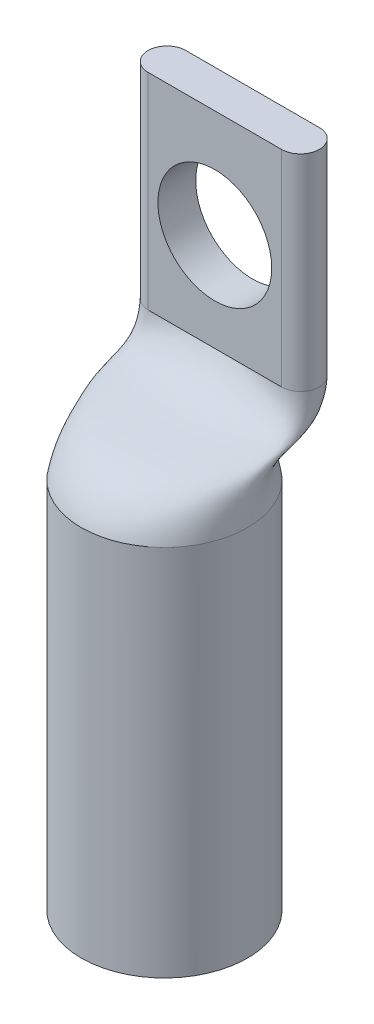
ISO-10303-21;
HEADER;
FILE_DESCRIPTION(('STEP AP214'),'2;1');
FILE_NAME('part.step','',(''),(''),'','','');
FILE_SCHEMA(('AUTOMOTIVE_DESIGN { 1 0 10303 214 1 1 1 1 }'));
ENDSEC;
DATA;
#1=APPLICATION_CONTEXT('core data for automotive mechanical design processes');
#2=APPLICATION_PROTOCOL_DEFINITION('international standard','automotive_design',2000,#1);
#3=PRODUCT_CONTEXT('',#1,'mechanical');
#4=PRODUCT('Part','Part','',(#3));
#5=PRODUCT_RELATED_PRODUCT_CATEGORY('part','',(#4));
#6=PRODUCT_DEFINITION_FORMATION('','',#4);
#7=PRODUCT_DEFINITION_CONTEXT('part definition',#1,'design');
#8=PRODUCT_DEFINITION('design','',#6,#7);
#9=PRODUCT_DEFINITION_SHAPE('','',#8);
#10=(LENGTH_UNIT() NAMED_UNIT(*) SI_UNIT(.MILLI.,.METRE.));
#11=(NAMED_UNIT(*) PLANE_ANGLE_UNIT() SI_UNIT($,.RADIAN.));
#12=(NAMED_UNIT(*) SI_UNIT($,.STERADIAN.) SOLID_ANGLE_UNIT());
#13=UNCERTAINTY_MEASURE_WITH_UNIT(LENGTH_MEASURE(1.E-05),#10,'distance_accuracy_value','');
#14=(GEOMETRIC_REPRESENTATION_CONTEXT(3) GLOBAL_UNCERTAINTY_ASSIGNED_CONTEXT((#13)) GLOBAL_UNIT_ASSIGNED_CONTEXT((#10,
#11,#12)) REPRESENTATION_CONTEXT('',''));
#15=CARTESIAN_POINT('',(0.,0.,0.));
#16=DIRECTION('',(0.,0.,1.));
#17=DIRECTION('',(1.,0.,0.));
#18=AXIS2_PLACEMENT_3D('',#15,#16,#17);
#19=CARTESIAN_POINT('',(0.,22.5552,0.));
#20=DIRECTION('',(0.,-1.,0.));
#21=DIRECTION('',(0.,0.,-1.));
#22=AXIS2_PLACEMENT_3D('',#19,#20,#21);
#23=CYLINDRICAL_SURFACE('',#22,5.0292);
#24=CARTESIAN_POINT('',(0.,22.5552,5.0292));
#25=CARTESIAN_POINT('',(0.565003535712212,22.5552,5.0292));
#26=CARTESIAN_POINT('',(1.74173787147774,22.5552,4.83391292208376));
#27=CARTESIAN_POINT('',(3.32282143010614,22.5552,3.91513447500991));
#28=CARTESIAN_POINT('',(4.42651562695378,22.5552,2.57113400399745));
#29=CARTESIAN_POINT('',(4.79679303246483,22.5552,1.5886920694497));
#30=CARTESIAN_POINT('',(4.93875651309624,22.5552,0.961686696660969));
#31=CARTESIAN_POINT('',(4.98610028735867,22.5552,0.69925596259311));
#32=CARTESIAN_POINT('',(5.01801373395576,22.5552,0.366689213128491));
#33=CARTESIAN_POINT('',(5.03195664756186,22.5552,0.0502353168386094));
#34=CARTESIAN_POINT('',(5.02649935860845,22.5552,-0.257972690983758));
#35=CARTESIAN_POINT('',(5.00021219752697,22.5552,-0.565801775045835));
#36=CARTESIAN_POINT('',(4.9537543619307,22.5552,-0.880528507479231));
#37=CARTESIAN_POINT('',(4.88778504943293,22.5552,-1.20942946041556));
#38=CARTESIAN_POINT('',(4.81230012588817,22.5552,-1.46936391005863));
#39=CARTESIAN_POINT('',(4.60765387433841,22.5552,-2.07193342851068));
#40=CARTESIAN_POINT('',(4.15884205058131,22.5552,-2.96244378646528));
#41=CARTESIAN_POINT('',(3.0681828198682,22.5552,-4.0897903902112));
#42=CARTESIAN_POINT('',(1.63275308276854,22.5552,-4.8499106931142));
#43=CARTESIAN_POINT('',(0.,22.5552,-5.11906417666359));
#44=CARTESIAN_POINT('',(-1.63275308276853,22.5552,-4.8499106931142));
#45=CARTESIAN_POINT('',(-3.06818281986821,22.5552,-4.0897903902112));
#46=CARTESIAN_POINT('',(-4.1588420505813,22.5552,-2.96244378646527));
#47=CARTESIAN_POINT('',(-4.60765387433841,22.5552,-2.07193342851068));
#48=CARTESIAN_POINT('',(-4.81230012588817,22.5552,-1.46936391005863));
#49=CARTESIAN_POINT('',(-4.88778504943293,22.5552,-1.20942946041555));
#50=CARTESIAN_POINT('',(-4.9537543619307,22.5552,-0.880528507479231));
#51=CARTESIAN_POINT('',(-5.00021219752697,22.5552,-0.565801775045837));
#52=CARTESIAN_POINT('',(-5.02649935860845,22.5552,-0.25797269098376));
#53=CARTESIAN_POINT('',(-5.03195664756186,22.5552,0.0502353168386068));
#54=CARTESIAN_POINT('',(-5.01801373395575,22.5552,0.366689213128489));
#55=CARTESIAN_POINT('',(-4.98610028735867,22.5552,0.699255962593107));
#56=CARTESIAN_POINT('',(-4.93875651309624,22.5552,0.961686696660966));
#57=CARTESIAN_POINT('',(-4.79679303246483,22.5552,1.5886920694497));
#58=CARTESIAN_POINT('',(-4.4265156269538,22.5552,2.57113400399745));
#59=CARTESIAN_POINT('',(-3.32282143010613,22.5552,3.9151344750099));
#60=CARTESIAN_POINT('',(-1.74173787147775,22.5552,4.83391292208376));
#61=CARTESIAN_POINT('',(-0.565003535712213,22.5552,5.0292));
#62=CARTESIAN_POINT('',(0.,22.5552,5.0292));
#63=B_SPLINE_CURVE_WITH_KNOTS('',3,(#24,#25,#26,#27,#28,#29,#30,#31,#32,#33,#34,#35,#36,#37,#38,
#39,#40,#41,#42,#43,#44,#45,#46,#47,#48,#49,#50,#51,#52,#53,#54,#55,#56,#57,#58,#59,#60,#61,
#62),.UNSPECIFIED.,.T.,.F.,(4,1,1,1,2,1,1,1,1,1,1,1,2,1,1,1,1,1,1,1,2,1,1,1,1,1,1,1,2,1,1,1,4),
(0.,0.0484531112377626,0.0969062224755251,0.145359333713288,0.19381244495105,0.208901194509636,
0.223989944068222,0.239078693626807,0.254167443185393,0.269256192743978,0.284344942302564,
0.29943369186115,0.314522441419735,0.360891831064801,0.407261220709868,0.453630610354934,0.5,
0.546369389645066,0.592738779290132,0.639108168935199,0.685477558580265,0.70056630813885,
0.715655057697436,0.730743807256022,0.745832556814607,0.760921306373193,0.776010055931778,
0.791098805490364,0.80618755504895,0.854640666286712,0.903093777524475,0.951546888762237,1.),.UNSPECIFIED.);
#64=CARTESIAN_POINT('',(0.,22.5552,5.0292));
#65=VERTEX_POINT('',#64);
#66=EDGE_CURVE('E13',#65,#65,#63,.T.);
#67=ORIENTED_EDGE('',*,*,#66,.F.);
#68=EDGE_LOOP('',(#67));
#69=FACE_BOUND('',#68,.T.);
#70=CARTESIAN_POINT('',(0.,0.,0.));
#71=DIRECTION('',(0.,1.,0.));
#72=DIRECTION('',(0.,0.,1.));
#73=AXIS2_PLACEMENT_3D('',#70,#71,#72);
#74=CIRCLE('',#73,5.0292);
#75=CARTESIAN_POINT('',(0.,0.,5.0292));
#76=VERTEX_POINT('',#75);
#77=EDGE_CURVE('E155',#76,#76,#74,.T.);
#78=ORIENTED_EDGE('',*,*,#77,.T.);
#79=EDGE_LOOP('',(#78));
#80=FACE_BOUND('',#79,.T.);
#81=ADVANCED_FACE('F145',(#69,#80),#23,.T.);
#82=CARTESIAN_POINT('',(0.,0.,0.));
#83=DIRECTION('',(0.,1.,0.));
#84=DIRECTION('',(0.,0.,1.));
#85=AXIS2_PLACEMENT_3D('',#82,#83,#84);
#86=PLANE('',#85);
#87=CARTESIAN_POINT('',(0.,0.,0.));
#88=DIRECTION('',(0.,-1.,0.));
#89=DIRECTION('',(0.,0.,-1.));
#90=AXIS2_PLACEMENT_3D('',#87,#88,#89);
#91=CIRCLE('',#90,3.683);
#92=CARTESIAN_POINT('',(0.,0.,-3.683));
#93=VERTEX_POINT('',#92);
#94=EDGE_CURVE('E298',#93,#93,#91,.T.);
#95=ORIENTED_EDGE('',*,*,#94,.F.);
#96=EDGE_LOOP('',(#95));
#97=FACE_BOUND('',#96,.T.);
#98=ORIENTED_EDGE('',*,*,#77,.F.);
#99=EDGE_LOOP('',(#98));
#100=FACE_BOUND('',#99,.T.);
#101=ADVANCED_FACE('F308',(#97,#100),#86,.F.);
#102=CARTESIAN_POINT('',(0.,27.8892,0.));
#103=DIRECTION('',(0.,-1.,0.));
#104=DIRECTION('',(0.,0.,-1.));
#105=AXIS2_PLACEMENT_3D('',#102,#103,#104);
#106=CYLINDRICAL_SURFACE('',#105,3.683);
#107=CARTESIAN_POINT('',(0.,22.5552,0.));
#108=DIRECTION('',(0.,1.,0.));
#109=DIRECTION('',(0.,0.,1.));
#110=AXIS2_PLACEMENT_3D('',#107,#108,#109);
#111=CIRCLE('',#110,3.683);
#112=CARTESIAN_POINT('',(0.,22.5552,3.683));
#113=VERTEX_POINT('',#112);
#114=EDGE_CURVE('E259',#113,#113,#111,.F.);
#115=ORIENTED_EDGE('',*,*,#114,.F.);
#116=EDGE_LOOP('',(#115));
#117=FACE_BOUND('',#116,.T.);
#118=ORIENTED_EDGE('',*,*,#94,.T.);
#119=EDGE_LOOP('',(#118));
#120=FACE_BOUND('',#119,.T.);
#121=ADVANCED_FACE('F305',(#117,#120),#106,.F.);
#122=CARTESIAN_POINT('',(0.,22.5552,0.));
#123=DIRECTION('',(0.,1.,0.));
#124=DIRECTION('',(0.,0.,1.));
#125=AXIS2_PLACEMENT_3D('',#122,#123,#124);
#126=PLANE('',#125);
#127=ORIENTED_EDGE('',*,*,#114,.T.);
#128=EDGE_LOOP('',(#127));
#129=FACE_BOUND('',#128,.T.);
#130=ADVANCED_FACE('F303',(#129),#126,.F.);
#131=CARTESIAN_POINT('',(0.,22.5552,5.0292));
#132=CARTESIAN_POINT('',(0.,26.7626227358973,3.6868671975364));
#133=CARTESIAN_POINT('',(0.,24.2731069858936,-1.39073043871304));
#134=CARTESIAN_POINT('',(0.,27.9,-3.048));
#135=CARTESIAN_POINT('',(0.565003535712212,22.5552,5.0292));
#136=CARTESIAN_POINT('',(0.488852357141475,26.7626227358973,3.6868671975364));
#137=CARTESIAN_POINT('',(0.412701178570737,24.2731069858936,-1.39073043871304));
#138=CARTESIAN_POINT('',(0.33655,27.9,-3.048));
#139=CARTESIAN_POINT('',(1.74173787147774,22.5552,4.83391292208376));
#140=CARTESIAN_POINT('',(1.49010698302913,26.7626227358973,3.5566758122589));
#141=CARTESIAN_POINT('',(1.23847609458051,24.2731069858936,-1.45582613135179));
#142=CARTESIAN_POINT('',(0.986845206131904,27.9,-3.048));
#143=CARTESIAN_POINT('',(3.32282143010614,22.5552,3.91513447500991));
#144=CARTESIAN_POINT('',(2.86382426973833,26.7626227358973,2.944156847543));
#145=CARTESIAN_POINT('',(2.40482710937052,24.2731069858936,-1.76208561370975));
#146=CARTESIAN_POINT('',(1.94582994900271,27.9,-3.04800000000001));
#147=CARTESIAN_POINT('',(4.42651562695378,22.5552,2.57113400399745));
#148=CARTESIAN_POINT('',(3.92880476757705,26.7626227358973,2.0481565335347));
#149=CARTESIAN_POINT('',(3.43109390820032,24.2731069858936,-2.21008577071389));
#150=CARTESIAN_POINT('',(2.93338304882358,27.9,-3.048));
#151=CARTESIAN_POINT('',(4.79679303246483,22.5552,1.5886920694497));
#152=CARTESIAN_POINT('',(4.4134689291573,26.7626227358973,1.3931952438362));
#153=CARTESIAN_POINT('',(4.03014482584978,24.2731069858936,-2.53756641556314));
#154=CARTESIAN_POINT('',(3.64682072254225,27.9,-3.048));
#155=CARTESIAN_POINT('',(4.93875651309624,22.5552,0.961686696660969));
#156=CARTESIAN_POINT('',(4.67937224553908,26.7626227358973,0.975191661977044));
#157=CARTESIAN_POINT('',(4.41998797798192,24.2731069858936,-2.74656820649272));
#158=CARTESIAN_POINT('',(4.16060371042476,27.9,-3.048));
#159=CARTESIAN_POINT('',(4.98610028735867,22.5552,0.69925596259311));
#160=CARTESIAN_POINT('',(4.79730958023918,26.7626227358973,0.78720146032038));
#161=CARTESIAN_POINT('',(4.60851887311969,24.2731069858936,-2.86011787573819));
#162=CARTESIAN_POINT('',(4.41972816600021,27.9,-3.08710913683427));
#163=CARTESIAN_POINT('',(5.01801373395576,22.5552,0.366689213128491));
#164=CARTESIAN_POINT('',(4.94775101330283,26.7626227358973,0.493461396000666));
#165=CARTESIAN_POINT('',(4.8774882926499,24.2731069858935,-3.115031254913));
#166=CARTESIAN_POINT('',(4.80722557199697,27.8999999999999,-3.30319583086418));
#167=CARTESIAN_POINT('',(5.03195664756186,22.5552,0.0502353168386094));
#168=CARTESIAN_POINT('',(5.05760478104157,26.7626227358974,0.152462977992854));
#169=CARTESIAN_POINT('',(5.08325291452127,24.2731069858936,-3.48057419463874));
#170=CARTESIAN_POINT('',(5.10890104800097,27.9,-3.69328329230785));
#171=CARTESIAN_POINT('',(5.02649935860845,22.5552,-0.257972690983758));
#172=CARTESIAN_POINT('',(5.09139410080074,26.7626227358974,-0.22390065394068));
#173=CARTESIAN_POINT('',(5.15628884299302,24.2731069858936,-3.92509345068344));
#174=CARTESIAN_POINT('',(5.22118358518531,27.9,-4.20595817246372));
#175=CARTESIAN_POINT('',(5.00021219752697,22.5552,-0.565801775045835));
#176=CARTESIAN_POINT('',(5.03235786746374,26.7626227358973,-0.597827558654946));
#177=CARTESIAN_POINT('',(5.0645035374005,24.2731069858936,-4.3651181760499));
#178=CARTESIAN_POINT('',(5.09664920733727,27.9,-4.71208071848236));
#179=CARTESIAN_POINT('',(4.9537543619307,22.5552,-0.880528507479231));
#180=CARTESIAN_POINT('',(4.90007616320691,26.7626227358973,-0.933459115513332));
#181=CARTESIAN_POINT('',(4.84639796448311,24.2731069858935,-4.72165455733327));
#182=CARTESIAN_POINT('',(4.79271976575932,27.9,-5.08952192419073));
#183=CARTESIAN_POINT('',(4.88778504943293,22.5552,-1.20942946041556));
#184=CARTESIAN_POINT('',(4.72896887715214,26.7626227358973,-1.22175270617314));
#185=CARTESIAN_POINT('',(4.57015270487134,24.2731069858935,-4.96934078571655));
#186=CARTESIAN_POINT('',(4.41133653259055,27.9,-5.29660079029749));
#187=CARTESIAN_POINT('',(4.81230012588817,22.5552,-1.46936391005863));
#188=CARTESIAN_POINT('',(4.59418690747122,26.7626227358973,-1.40750874250269));
#189=CARTESIAN_POINT('',(4.37607368905427,24.2731069858936,-5.08091840873259));
#190=CARTESIAN_POINT('',(4.15796047063733,27.9,-5.334));
#191=CARTESIAN_POINT('',(4.60765387433841,22.5552,-2.07193342851068));
#192=CARTESIAN_POINT('',(4.29569995671314,26.7626227358973,-1.80922175480406));
#193=CARTESIAN_POINT('',(3.98374603908787,24.2731069858936,-5.28177491488327));
#194=CARTESIAN_POINT('',(3.6717921214626,27.9,-5.334));
#195=CARTESIAN_POINT('',(4.15884205058131,22.5552,-2.96244378646528));
#196=CARTESIAN_POINT('',(3.76043830605454,26.7626227358973,-2.40289532677379));
#197=CARTESIAN_POINT('',(3.36203456152777,24.2731069858936,-5.57861170086814));
#198=CARTESIAN_POINT('',(2.96363081700099,27.9,-5.334));
#199=CARTESIAN_POINT('',(3.0681828198682,22.5552,-4.0897903902112));
#200=CARTESIAN_POINT('',(2.69650164366813,26.7626227358973,-3.15445972927107));
#201=CARTESIAN_POINT('',(2.32482046746806,24.2731069858935,-5.95439390211678));
#202=CARTESIAN_POINT('',(1.95313929126798,27.9,-5.334));
#203=CARTESIAN_POINT('',(1.63275308276854,22.5552,-4.8499106931142));
#204=CARTESIAN_POINT('',(1.41176381171709,26.7626227358974,-3.66120659787307));
#205=CARTESIAN_POINT('',(1.19077454066564,24.2731069858936,-6.20776733641778));
#206=CARTESIAN_POINT('',(0.969785269614189,27.9,-5.334));
#207=CARTESIAN_POINT('',(0.,22.5552,-5.11906417666359));
#208=CARTESIAN_POINT('',(0.,26.7626227358973,-3.84064225357266));
#209=CARTESIAN_POINT('',(0.,24.2731069858936,-6.29748516426757));
#210=CARTESIAN_POINT('',(0.,27.9,-5.334));
#211=CARTESIAN_POINT('',(-1.63275308276853,22.5552,-4.8499106931142));
#212=CARTESIAN_POINT('',(-1.41176381171708,26.7626227358973,-3.66120659787307));
#213=CARTESIAN_POINT('',(-1.19077454066563,24.2731069858935,-6.20776733641778));
#214=CARTESIAN_POINT('',(-0.969785269614187,27.9,-5.334));
#215=CARTESIAN_POINT('',(-3.06818281986821,22.5552,-4.0897903902112));
#216=CARTESIAN_POINT('',(-2.69650164366814,26.7626227358973,-3.15445972927107));
#217=CARTESIAN_POINT('',(-2.32482046746806,24.2731069858936,-5.95439390211678));
#218=CARTESIAN_POINT('',(-1.95313929126798,27.9,-5.334));
#219=CARTESIAN_POINT('',(-4.1588420505813,22.5552,-2.96244378646527));
#220=CARTESIAN_POINT('',(-3.76043830605453,26.7626227358973,-2.40289532677378));
#221=CARTESIAN_POINT('',(-3.36203456152776,24.2731069858935,-5.57861170086813));
#222=CARTESIAN_POINT('',(-2.96363081700099,27.9,-5.334));
#223=CARTESIAN_POINT('',(-4.60765387433841,22.5552,-2.07193342851068));
#224=CARTESIAN_POINT('',(-4.29569995671314,26.7626227358973,-1.80922175480406));
#225=CARTESIAN_POINT('',(-3.98374603908787,24.2731069858936,-5.28177491488327));
#226=CARTESIAN_POINT('',(-3.6717921214626,27.9,-5.334));
#227=CARTESIAN_POINT('',(-4.81230012588817,22.5552,-1.46936391005863));
#228=CARTESIAN_POINT('',(-4.59418690747122,26.7626227358973,-1.40750874250269));
#229=CARTESIAN_POINT('',(-4.37607368905427,24.2731069858936,-5.08091840873258));
#230=CARTESIAN_POINT('',(-4.15796047063733,27.9,-5.334));
#231=CARTESIAN_POINT('',(-4.88778504943293,22.5552,-1.20942946041555));
#232=CARTESIAN_POINT('',(-4.72896887715213,26.7626227358973,-1.22175270617313));
#233=CARTESIAN_POINT('',(-4.57015270487133,24.2731069858935,-4.96934078571655));
#234=CARTESIAN_POINT('',(-4.41133653259054,27.8999999999999,-5.29660079029748));
#235=CARTESIAN_POINT('',(-4.9537543619307,22.5552,-0.880528507479231));
#236=CARTESIAN_POINT('',(-4.90007616320691,26.7626227358973,-0.933459115513332));
#237=CARTESIAN_POINT('',(-4.84639796448312,24.2731069858936,-4.72165455733327));
#238=CARTESIAN_POINT('',(-4.79271976575933,27.9,-5.08952192419073));
#239=CARTESIAN_POINT('',(-5.00021219752697,22.5552,-0.565801775045837));
#240=CARTESIAN_POINT('',(-5.03235786746373,26.7626227358973,-0.597827558654951));
#241=CARTESIAN_POINT('',(-5.0645035374005,24.2731069858935,-4.3651181760499));
#242=CARTESIAN_POINT('',(-5.09664920733726,27.8999999999999,-4.71208071848237));
#243=CARTESIAN_POINT('',(-5.02649935860845,22.5552,-0.25797269098376));
#244=CARTESIAN_POINT('',(-5.09139410080074,26.7626227358973,-0.223900653940676));
#245=CARTESIAN_POINT('',(-5.15628884299302,24.2731069858936,-3.92509345068343));
#246=CARTESIAN_POINT('',(-5.22118358518531,27.9,-4.2059581724637));
#247=CARTESIAN_POINT('',(-5.03195664756186,22.5552,0.0502353168386068));
#248=CARTESIAN_POINT('',(-5.05760478104157,26.7626227358973,0.152462977992846));
#249=CARTESIAN_POINT('',(-5.08325291452128,24.2731069858935,-3.48057419463875));
#250=CARTESIAN_POINT('',(-5.10890104800098,27.9,-3.69328329230787));
#251=CARTESIAN_POINT('',(-5.01801373395575,22.5552,0.366689213128489));
#252=CARTESIAN_POINT('',(-4.94775101330282,26.7626227358973,0.493461396000666));
#253=CARTESIAN_POINT('',(-4.87748829264989,24.2731069858936,-3.115031254913));
#254=CARTESIAN_POINT('',(-4.80722557199696,27.9,-3.30319583086417));
#255=CARTESIAN_POINT('',(-4.98610028735867,22.5552,0.699255962593107));
#256=CARTESIAN_POINT('',(-4.79730958023918,26.7626227358973,0.787201460320376));
#257=CARTESIAN_POINT('',(-4.6085188731197,24.2731069858936,-2.86011787573819));
#258=CARTESIAN_POINT('',(-4.41972816600022,27.9,-3.08710913683428));
#259=CARTESIAN_POINT('',(-4.93875651309624,22.5552,0.961686696660966));
#260=CARTESIAN_POINT('',(-4.67937224553908,26.7626227358973,0.975191661977042));
#261=CARTESIAN_POINT('',(-4.41998797798192,24.2731069858936,-2.74656820649272));
#262=CARTESIAN_POINT('',(-4.16060371042476,27.9,-3.048));
#263=CARTESIAN_POINT('',(-4.79679303246483,22.5552,1.5886920694497));
#264=CARTESIAN_POINT('',(-4.4134689291573,26.7626227358973,1.3931952438362));
#265=CARTESIAN_POINT('',(-4.03014482584978,24.2731069858936,-2.53756641556314));
#266=CARTESIAN_POINT('',(-3.64682072254225,27.9,-3.048));
#267=CARTESIAN_POINT('',(-4.4265156269538,22.5552,2.57113400399745));
#268=CARTESIAN_POINT('',(-3.92880476757706,26.7626227358974,2.0481565335347));
#269=CARTESIAN_POINT('',(-3.43109390820032,24.2731069858936,-2.21008577071389));
#270=CARTESIAN_POINT('',(-2.93338304882359,27.9,-3.048));
#271=CARTESIAN_POINT('',(-3.32282143010613,22.5552,3.9151344750099));
#272=CARTESIAN_POINT('',(-2.86382426973832,26.7626227358973,2.944156847543));
#273=CARTESIAN_POINT('',(-2.40482710937051,24.2731069858936,-1.76208561370974));
#274=CARTESIAN_POINT('',(-1.94582994900271,27.9,-3.048));
#275=CARTESIAN_POINT('',(-1.74173787147775,22.5552,4.83391292208376));
#276=CARTESIAN_POINT('',(-1.49010698302913,26.7626227358973,3.5566758122589));
#277=CARTESIAN_POINT('',(-1.23847609458052,24.2731069858936,-1.45582613135179));
#278=CARTESIAN_POINT('',(-0.986845206131905,27.9,-3.048));
#279=CARTESIAN_POINT('',(-0.565003535712213,22.5552,5.0292));
#280=CARTESIAN_POINT('',(-0.488852357141476,26.7626227358973,3.6868671975364));
#281=CARTESIAN_POINT('',(-0.412701178570738,24.2731069858936,-1.39073043871304));
#282=CARTESIAN_POINT('',(-0.33655,27.9,-3.048));
#283=CARTESIAN_POINT('',(0.,22.5552,5.0292));
#284=CARTESIAN_POINT('',(0.,26.7626227358973,3.6868671975364));
#285=CARTESIAN_POINT('',(0.,24.2731069858936,-1.39073043871304));
#286=CARTESIAN_POINT('',(0.,27.9,-3.048));
#287=B_SPLINE_SURFACE_WITH_KNOTS('',3,3,((#131,#132,#133,#134),(#135,#136,#137,#138),(#139,#140,
#141,#142),(#143,#144,#145,#146),(#147,#148,#149,#150),(#151,#152,#153,#154),(#155,#156,#157,
#158),(#159,#160,#161,#162),(#163,#164,#165,#166),(#167,#168,#169,#170),(#171,#172,#173,#174),
(#175,#176,#177,#178),(#179,#180,#181,#182),(#183,#184,#185,#186),(#187,#188,#189,#190),(#191,
#192,#193,#194),(#195,#196,#197,#198),(#199,#200,#201,#202),(#203,#204,#205,#206),(#207,#208,
#209,#210),(#211,#212,#213,#214),(#215,#216,#217,#218),(#219,#220,#221,#222),(#223,#224,#225,
#226),(#227,#228,#229,#230),(#231,#232,#233,#234),(#235,#236,#237,#238),(#239,#240,#241,#242),
(#243,#244,#245,#246),(#247,#248,#249,#250),(#251,#252,#253,#254),(#255,#256,#257,#258),(#259,
#260,#261,#262),(#263,#264,#265,#266),(#267,#268,#269,#270),(#271,#272,#273,#274),(#275,#276,
#277,#278),(#279,#280,#281,#282),(#283,#284,#285,#286)),.UNSPECIFIED.,.T.,.F.,.F.,(4,1,1,1,2,1,
1,1,1,1,1,1,2,1,1,1,1,1,1,1,2,1,1,1,1,1,1,1,2,1,1,1,4),(4,4),(0.,0.0484531112377626,
0.0969062224755251,0.145359333713288,0.19381244495105,0.208901194509636,0.223989944068222,
0.239078693626807,0.254167443185393,0.269256192743978,0.284344942302564,0.29943369186115,
0.314522441419735,0.360891831064801,0.407261220709868,0.453630610354934,0.5,0.546369389645066,
0.592738779290132,0.639108168935199,0.685477558580265,0.70056630813885,0.715655057697436,
0.730743807256022,0.745832556814607,0.760921306373193,0.776010055931778,0.791098805490364,
0.80618755504895,0.854640666286712,0.903093777524475,0.951546888762237,1.),(0.,1.),.UNSPECIFIED.);
#288=CARTESIAN_POINT('',(4.0386,27.9,-4.191));
#289=DIRECTION('',(0.,1.,0.));
#290=DIRECTION('',(0.,0.,1.));
#291=AXIS2_PLACEMENT_3D('',#288,#289,#290);
#292=CIRCLE('',#291,1.143);
#293=CARTESIAN_POINT('',(4.0386,27.9,-3.048));
#294=VERTEX_POINT('',#293);
#295=CARTESIAN_POINT('',(4.0386,27.9,-5.334));
#296=VERTEX_POINT('',#295);
#297=EDGE_CURVE('E149',#294,#296,#292,.T.);
#298=DIRECTION('',(1.,0.,0.));
#299=VECTOR('',#298,1.);
#300=CARTESIAN_POINT('',(-4.0386,27.9,-3.048));
#301=LINE('',#300,#299);
#302=CARTESIAN_POINT('',(-4.0386,27.9,-3.048));
#303=VERTEX_POINT('',#302);
#304=EDGE_CURVE('E212',#303,#294,#301,.T.);
#305=CARTESIAN_POINT('',(-4.0386,27.9,-4.191));
#306=DIRECTION('',(0.,1.,0.));
#307=DIRECTION('',(0.,0.,1.));
#308=AXIS2_PLACEMENT_3D('',#305,#306,#307);
#309=CIRCLE('',#308,1.143);
#310=CARTESIAN_POINT('',(-4.0386,27.9,-5.334));
#311=VERTEX_POINT('',#310);
#312=EDGE_CURVE('E168',#311,#303,#309,.T.);
#313=DIRECTION('',(-1.,0.,0.));
#314=VECTOR('',#313,1.);
#315=CARTESIAN_POINT('',(4.0386,27.9,-5.334));
#316=LINE('',#315,#314);
#317=EDGE_CURVE('E162',#296,#311,#316,.T.);
#318=ORIENTED_EDGE('',*,*,#66,.T.);
#319=EDGE_LOOP('',(#318));
#320=FACE_BOUND('',#319,.T.);
#321=ORIENTED_EDGE('',*,*,#297,.F.);
#322=ORIENTED_EDGE('',*,*,#304,.F.);
#323=ORIENTED_EDGE('',*,*,#312,.F.);
#324=ORIENTED_EDGE('',*,*,#317,.F.);
#325=EDGE_LOOP('',(#321,#322,#323,#324));
#326=FACE_BOUND('',#325,.T.);
#327=ADVANCED_FACE('F333',(#320,#326),#287,.T.);
#328=CARTESIAN_POINT('',(4.0386,40.346,-4.191));
#329=DIRECTION('',(0.,-1.,0.));
#330=DIRECTION('',(0.,0.,-1.));
#331=AXIS2_PLACEMENT_3D('',#328,#329,#330);
#332=CYLINDRICAL_SURFACE('',#331,1.143);
#333=ORIENTED_EDGE('',*,*,#297,.T.);
#334=DIRECTION('',(0.,-1.,0.));
#335=VECTOR('',#334,1.);
#336=CARTESIAN_POINT('',(4.0386,40.346,-5.334));
#337=LINE('',#336,#335);
#338=CARTESIAN_POINT('',(4.0386,40.346,-5.334));
#339=VERTEX_POINT('',#338);
#340=EDGE_CURVE('E191',#339,#296,#337,.T.);
#341=ORIENTED_EDGE('',*,*,#340,.F.);
#342=CARTESIAN_POINT('',(4.0386,40.346,-4.191));
#343=DIRECTION('',(0.,1.,0.));
#344=DIRECTION('',(0.,0.,1.));
#345=AXIS2_PLACEMENT_3D('',#342,#343,#344);
#346=CIRCLE('',#345,1.143);
#347=CARTESIAN_POINT('',(4.0386,40.346,-3.048));
#348=VERTEX_POINT('',#347);
#349=EDGE_CURVE('E198',#348,#339,#346,.T.);
#350=ORIENTED_EDGE('',*,*,#349,.F.);
#351=DIRECTION('',(0.,-1.,0.));
#352=VECTOR('',#351,1.);
#353=CARTESIAN_POINT('',(4.0386,40.346,-3.048));
#354=LINE('',#353,#352);
#355=EDGE_CURVE('E405',#348,#294,#354,.T.);
#356=ORIENTED_EDGE('',*,*,#355,.T.);
#357=EDGE_LOOP('',(#333,#341,#350,#356));
#358=FACE_BOUND('',#357,.T.);
#359=ADVANCED_FACE('F209',(#358),#332,.T.);
#360=CARTESIAN_POINT('',(4.0386,40.346,-5.334));
#361=DIRECTION('',(0.,0.,1.));
#362=DIRECTION('',(1.,0.,0.));
#363=AXIS2_PLACEMENT_3D('',#360,#361,#362);
#364=PLANE('',#363);
#365=CARTESIAN_POINT('',(0.,33.8309,-5.334));
#366=DIRECTION('',(0.,0.,1.));
#367=DIRECTION('',(1.,0.,0.));
#368=AXIS2_PLACEMENT_3D('',#365,#366,#367);
#369=CIRCLE('',#368,3.4417);
#370=CARTESIAN_POINT('',(3.4417,33.8309,-5.334));
#371=VERTEX_POINT('',#370);
#372=EDGE_CURVE('E207',#371,#371,#369,.F.);
#373=ORIENTED_EDGE('',*,*,#372,.F.);
#374=EDGE_LOOP('',(#373));
#375=FACE_BOUND('',#374,.T.);
#376=ORIENTED_EDGE('',*,*,#317,.T.);
#377=DIRECTION('',(0.,-1.,0.));
#378=VECTOR('',#377,1.);
#379=CARTESIAN_POINT('',(-4.0386,40.346,-5.334));
#380=LINE('',#379,#378);
#381=CARTESIAN_POINT('',(-4.0386,40.346,-5.334));
#382=VERTEX_POINT('',#381);
#383=EDGE_CURVE('E194',#382,#311,#380,.T.);
#384=ORIENTED_EDGE('',*,*,#383,.F.);
#385=DIRECTION('',(-1.,0.,0.));
#386=VECTOR('',#385,1.);
#387=CARTESIAN_POINT('',(4.0386,40.346,-5.334));
#388=LINE('',#387,#386);
#389=EDGE_CURVE('E187',#339,#382,#388,.T.);
#390=ORIENTED_EDGE('',*,*,#389,.F.);
#391=ORIENTED_EDGE('',*,*,#340,.T.);
#392=EDGE_LOOP('',(#376,#384,#390,#391));
#393=FACE_BOUND('',#392,.T.);
#394=ADVANCED_FACE('F189',(#375,#393),#364,.F.);
#395=CARTESIAN_POINT('',(-4.0386,40.346,-4.191));
#396=DIRECTION('',(0.,-1.,0.));
#397=DIRECTION('',(0.,0.,-1.));
#398=AXIS2_PLACEMENT_3D('',#395,#396,#397);
#399=CYLINDRICAL_SURFACE('',#398,1.143);
#400=ORIENTED_EDGE('',*,*,#312,.T.);
#401=DIRECTION('',(0.,-1.,0.));
#402=VECTOR('',#401,1.);
#403=CARTESIAN_POINT('',(-4.0386,40.346,-3.048));
#404=LINE('',#403,#402);
#405=CARTESIAN_POINT('',(-4.0386,40.346,-3.048));
#406=VERTEX_POINT('',#405);
#407=EDGE_CURVE('E213',#406,#303,#404,.T.);
#408=ORIENTED_EDGE('',*,*,#407,.F.);
#409=CARTESIAN_POINT('',(-4.0386,40.346,-4.191));
#410=DIRECTION('',(0.,1.,0.));
#411=DIRECTION('',(0.,0.,1.));
#412=AXIS2_PLACEMENT_3D('',#409,#410,#411);
#413=CIRCLE('',#412,1.143);
#414=EDGE_CURVE('E197',#382,#406,#413,.T.);
#415=ORIENTED_EDGE('',*,*,#414,.F.);
#416=ORIENTED_EDGE('',*,*,#383,.T.);
#417=EDGE_LOOP('',(#400,#408,#415,#416));
#418=FACE_BOUND('',#417,.T.);
#419=ADVANCED_FACE('F229',(#418),#399,.T.);
#420=CARTESIAN_POINT('',(-4.0386,40.346,-3.048));
#421=DIRECTION('',(0.,0.,-1.));
#422=DIRECTION('',(-1.,0.,0.));
#423=AXIS2_PLACEMENT_3D('',#420,#421,#422);
#424=PLANE('',#423);
#425=CARTESIAN_POINT('',(0.,33.8309,-3.048));
#426=DIRECTION('',(0.,0.,1.));
#427=DIRECTION('',(1.,0.,0.));
#428=AXIS2_PLACEMENT_3D('',#425,#426,#427);
#429=CIRCLE('',#428,3.4417);
#430=CARTESIAN_POINT('',(3.4417,33.8309,-3.048));
#431=VERTEX_POINT('',#430);
#432=EDGE_CURVE('E398',#431,#431,#429,.T.);
#433=ORIENTED_EDGE('',*,*,#432,.F.);
#434=EDGE_LOOP('',(#433));
#435=FACE_BOUND('',#434,.T.);
#436=ORIENTED_EDGE('',*,*,#304,.T.);
#437=ORIENTED_EDGE('',*,*,#355,.F.);
#438=DIRECTION('',(1.,0.,0.));
#439=VECTOR('',#438,1.);
#440=CARTESIAN_POINT('',(-4.0386,40.346,-3.048));
#441=LINE('',#440,#439);
#442=EDGE_CURVE('E203',#406,#348,#441,.T.);
#443=ORIENTED_EDGE('',*,*,#442,.F.);
#444=ORIENTED_EDGE('',*,*,#407,.T.);
#445=EDGE_LOOP('',(#436,#437,#443,#444));
#446=FACE_BOUND('',#445,.T.);
#447=ADVANCED_FACE('F239',(#435,#446),#424,.F.);
#448=CARTESIAN_POINT('',(4.0386,40.346,-4.191));
#449=DIRECTION('',(0.,1.,0.));
#450=DIRECTION('',(0.,0.,1.));
#451=AXIS2_PLACEMENT_3D('',#448,#449,#450);
#452=PLANE('',#451);
#453=ORIENTED_EDGE('',*,*,#349,.T.);
#454=ORIENTED_EDGE('',*,*,#389,.T.);
#455=ORIENTED_EDGE('',*,*,#414,.T.);
#456=ORIENTED_EDGE('',*,*,#442,.T.);
#457=EDGE_LOOP('',(#453,#454,#455,#456));
#458=FACE_BOUND('',#457,.T.);
#459=ADVANCED_FACE('F201',(#458),#452,.T.);
#460=CARTESIAN_POINT('',(0.,33.8309,-5.335));
#461=DIRECTION('',(0.,0.,1.));
#462=DIRECTION('',(1.,0.,0.));
#463=AXIS2_PLACEMENT_3D('',#460,#461,#462);
#464=CYLINDRICAL_SURFACE('',#463,3.4417);
#465=CARTESIAN_POINT('',(3.4417,33.8309,-3.048));
#466=CARTESIAN_POINT('',(3.4417,33.8309,-3.0718125));
#467=CARTESIAN_POINT('',(3.4417,33.8309,-3.095625));
#468=CARTESIAN_POINT('',(3.4417,33.8309,-3.14325));
#469=CARTESIAN_POINT('',(3.4417,33.8309,-3.1670625));
#470=CARTESIAN_POINT('',(3.4417,33.8309,-3.2146875));
#471=CARTESIAN_POINT('',(3.4417,33.8309,-3.2385));
#472=CARTESIAN_POINT('',(3.4417,33.8309,-3.286125));
#473=CARTESIAN_POINT('',(3.4417,33.8309,-3.3099375));
#474=CARTESIAN_POINT('',(3.4417,33.8309,-3.3575625));
#475=CARTESIAN_POINT('',(3.4417,33.8309,-3.381375));
#476=CARTESIAN_POINT('',(3.4417,33.8309,-3.429));
#477=CARTESIAN_POINT('',(3.4417,33.8309,-3.4528125));
#478=CARTESIAN_POINT('',(3.4417,33.8309,-3.5004375));
#479=CARTESIAN_POINT('',(3.4417,33.8309,-3.52425));
#480=CARTESIAN_POINT('',(3.4417,33.8309,-3.571875));
#481=CARTESIAN_POINT('',(3.4417,33.8309,-3.5956875));
#482=CARTESIAN_POINT('',(3.4417,33.8309,-3.6433125));
#483=CARTESIAN_POINT('',(3.4417,33.8309,-3.667125));
#484=CARTESIAN_POINT('',(3.4417,33.8309,-3.71475));
#485=CARTESIAN_POINT('',(3.4417,33.8309,-3.7385625));
#486=CARTESIAN_POINT('',(3.4417,33.8309,-3.7861875));
#487=CARTESIAN_POINT('',(3.4417,33.8309,-3.81));
#488=CARTESIAN_POINT('',(3.4417,33.8309,-3.857625));
#489=CARTESIAN_POINT('',(3.4417,33.8309,-3.8814375));
#490=CARTESIAN_POINT('',(3.4417,33.8309,-3.9290625));
#491=CARTESIAN_POINT('',(3.4417,33.8309,-3.952875));
#492=CARTESIAN_POINT('',(3.4417,33.8309,-4.0005));
#493=CARTESIAN_POINT('',(3.4417,33.8309,-4.0243125));
#494=CARTESIAN_POINT('',(3.4417,33.8309,-4.0719375));
#495=CARTESIAN_POINT('',(3.4417,33.8309,-4.09575));
#496=CARTESIAN_POINT('',(3.4417,33.8309,-4.143375));
#497=CARTESIAN_POINT('',(3.4417,33.8309,-4.1671875));
#498=CARTESIAN_POINT('',(3.4417,33.8309,-4.2148125));
#499=CARTESIAN_POINT('',(3.4417,33.8309,-4.238625));
#500=CARTESIAN_POINT('',(3.4417,33.8309,-4.28625));
#501=CARTESIAN_POINT('',(3.4417,33.8309,-4.3100625));
#502=CARTESIAN_POINT('',(3.4417,33.8309,-4.3576875));
#503=CARTESIAN_POINT('',(3.4417,33.8309,-4.3815));
#504=CARTESIAN_POINT('',(3.4417,33.8309,-4.429125));
#505=CARTESIAN_POINT('',(3.4417,33.8309,-4.4529375));
#506=CARTESIAN_POINT('',(3.4417,33.8309,-4.5005625));
#507=CARTESIAN_POINT('',(3.4417,33.8309,-4.524375));
#508=CARTESIAN_POINT('',(3.4417,33.8309,-4.572));
#509=CARTESIAN_POINT('',(3.4417,33.8309,-4.5958125));
#510=CARTESIAN_POINT('',(3.4417,33.8309,-4.6434375));
#511=CARTESIAN_POINT('',(3.4417,33.8309,-4.66725));
#512=CARTESIAN_POINT('',(3.4417,33.8309,-4.714875));
#513=CARTESIAN_POINT('',(3.4417,33.8309,-4.7386875));
#514=CARTESIAN_POINT('',(3.4417,33.8309,-4.7863125));
#515=CARTESIAN_POINT('',(3.4417,33.8309,-4.810125));
#516=CARTESIAN_POINT('',(3.4417,33.8309,-4.85775));
#517=CARTESIAN_POINT('',(3.4417,33.8309,-4.8815625));
#518=CARTESIAN_POINT('',(3.4417,33.8309,-4.9291875));
#519=CARTESIAN_POINT('',(3.4417,33.8309,-4.953));
#520=CARTESIAN_POINT('',(3.4417,33.8309,-5.000625));
#521=CARTESIAN_POINT('',(3.4417,33.8309,-5.0244375));
#522=CARTESIAN_POINT('',(3.4417,33.8309,-5.0720625));
#523=CARTESIAN_POINT('',(3.4417,33.8309,-5.095875));
#524=CARTESIAN_POINT('',(3.4417,33.8309,-5.1435));
#525=CARTESIAN_POINT('',(3.4417,33.8309,-5.1673125));
#526=CARTESIAN_POINT('',(3.4417,33.8309,-5.2149375));
#527=CARTESIAN_POINT('',(3.4417,33.8309,-5.23875));
#528=CARTESIAN_POINT('',(3.4417,33.8309,-5.286375));
#529=CARTESIAN_POINT('',(3.4417,33.8309,-5.3101875));
#530=CARTESIAN_POINT('',(3.4417,33.8309,-5.334));
#531=B_SPLINE_CURVE_WITH_KNOTS('',3,(#465,#466,#467,#468,#469,#470,#471,#472,#473,#474,#475,
#476,#477,#478,#479,#480,#481,#482,#483,#484,#485,#486,#487,#488,#489,#490,#491,#492,#493,#494,
#495,#496,#497,#498,#499,#500,#501,#502,#503,#504,#505,#506,#507,#508,#509,#510,#511,#512,#513,
#514,#515,#516,#517,#518,#519,#520,#521,#522,#523,#524,#525,#526,#527,#528,#529,#530),
.UNSPECIFIED.,.F.,.F.,(4,2,2,2,2,2,2,2,2,2,2,2,2,2,2,2,2,2,2,2,2,2,2,2,2,2,2,2,2,2,2,2,4),(0.,
0.0714374999999999,0.142875,0.2143125,0.28575,0.3571875,0.428625,0.5000625,0.5715,0.6429375,
0.714375,0.7858125,0.85725,0.9286875,1.000125,1.0715625,1.143,1.2144375,1.285875,1.3573125,
1.42875,1.5001875,1.571625,1.6430625,1.7145,1.7859375,1.857375,1.9288125,2.00025,2.0716875,
2.143125,2.2145625,2.286),.UNSPECIFIED.);
#532=EDGE_CURVE('BSEAM364',#431,#371,#531,.T.);
#533=ORIENTED_EDGE('',*,*,#432,.T.);
#534=ORIENTED_EDGE('',*,*,#372,.T.);
#535=ORIENTED_EDGE('',*,*,#532,.T.);
#536=ORIENTED_EDGE('',*,*,#532,.F.);
#537=EDGE_LOOP('',(#533,#535,#534,#536));
#538=FACE_BOUND('',#537,.T.);
#539=ADVANCED_FACE('F364',(#538),#464,.F.);
#540=CLOSED_SHELL('',(#81,#101,#121,#130,#327,#359,#394,#419,#447,#459,#539));
#541=MANIFOLD_SOLID_BREP('B2',#540);
#542=ADVANCED_BREP_SHAPE_REPRESENTATION('',(#18,#541),#14);
#543=SHAPE_DEFINITION_REPRESENTATION(#9,#542);
ENDSEC;
END-ISO-10303-21;
